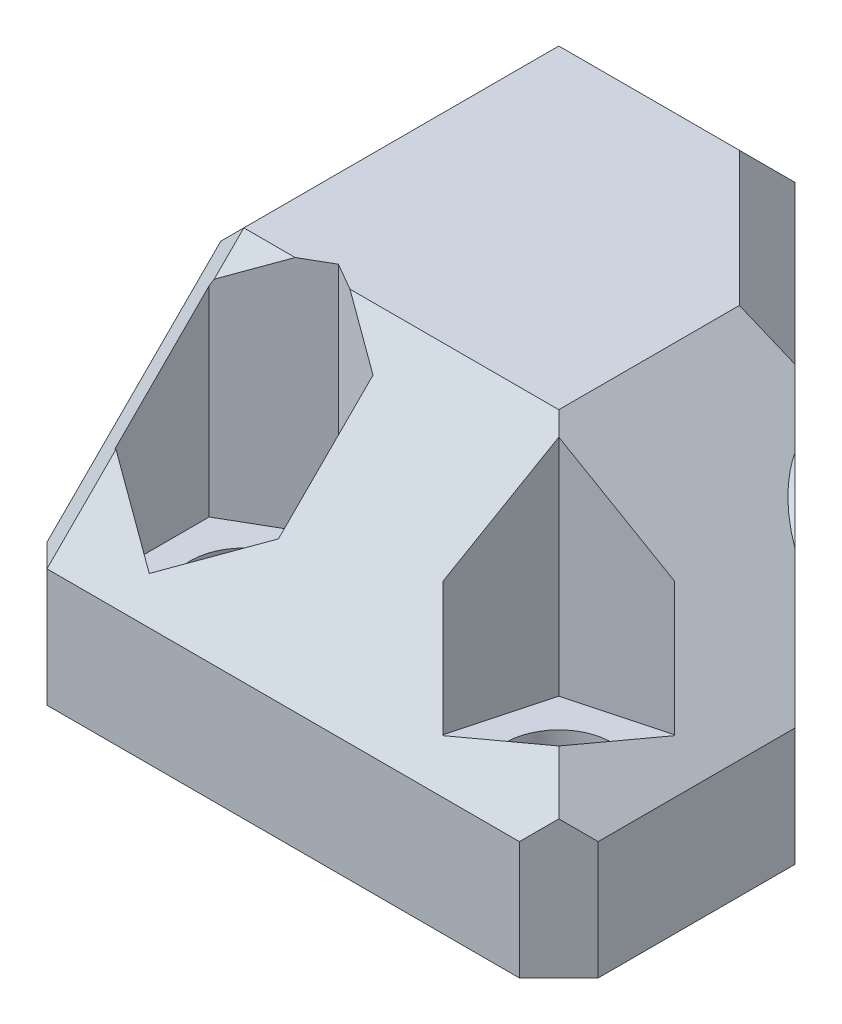
ISO-10303-21;
HEADER;
FILE_DESCRIPTION(('STEP AP214'),'2;1');
FILE_NAME('part.step','',(''),(''),'','','');
FILE_SCHEMA(('AUTOMOTIVE_DESIGN { 1 0 10303 214 1 1 1 1 }'));
ENDSEC;
DATA;
#1=APPLICATION_CONTEXT('core data for automotive mechanical design processes');
#2=APPLICATION_PROTOCOL_DEFINITION('international standard','automotive_design',2000,#1);
#3=PRODUCT_CONTEXT('',#1,'mechanical');
#4=PRODUCT('Part','Part','',(#3));
#5=PRODUCT_RELATED_PRODUCT_CATEGORY('part','',(#4));
#6=PRODUCT_DEFINITION_FORMATION('','',#4);
#7=PRODUCT_DEFINITION_CONTEXT('part definition',#1,'design');
#8=PRODUCT_DEFINITION('design','',#6,#7);
#9=PRODUCT_DEFINITION_SHAPE('','',#8);
#10=(LENGTH_UNIT() NAMED_UNIT(*) SI_UNIT(.MILLI.,.METRE.));
#11=(NAMED_UNIT(*) PLANE_ANGLE_UNIT() SI_UNIT($,.RADIAN.));
#12=(NAMED_UNIT(*) SI_UNIT($,.STERADIAN.) SOLID_ANGLE_UNIT());
#13=UNCERTAINTY_MEASURE_WITH_UNIT(LENGTH_MEASURE(1.E-05),#10,'distance_accuracy_value','');
#14=(GEOMETRIC_REPRESENTATION_CONTEXT(3) GLOBAL_UNCERTAINTY_ASSIGNED_CONTEXT((#13)) GLOBAL_UNIT_ASSIGNED_CONTEXT((#10,
#11,#12)) REPRESENTATION_CONTEXT('',''));
#15=CARTESIAN_POINT('',(0.,0.,0.));
#16=DIRECTION('',(0.,0.,1.));
#17=DIRECTION('',(1.,0.,0.));
#18=AXIS2_PLACEMENT_3D('',#15,#16,#17);
#19=CARTESIAN_POINT('',(6.35,7.93750000000017,6.35));
#20=DIRECTION('',(0.,-0.707106781186544,-0.707106781186551));
#21=DIRECTION('',(1.,0.,0.));
#22=AXIS2_PLACEMENT_3D('',#19,#20,#21);
#23=PLANE('',#22);
#24=DIRECTION('',(1.,0.,0.));
#25=VECTOR('',#24,1.);
#26=CARTESIAN_POINT('',(6.35,6.35,7.93750000000015));
#27=LINE('',#26,#25);
#28=CARTESIAN_POINT('',(-4.7625,6.35,7.93750000000015));
#29=VERTEX_POINT('',#28);
#30=CARTESIAN_POINT('',(-2.69223868596908,6.35,7.93750000000015));
#31=VERTEX_POINT('',#30);
#32=EDGE_CURVE('E259',#29,#31,#27,.T.);
#33=ORIENTED_EDGE('',*,*,#32,.F.);
#34=DIRECTION('',(0.,-0.707106781186551,0.707106781186544));
#35=VECTOR('',#34,1.);
#36=CARTESIAN_POINT('',(-4.7625,7.93750000000017,6.35));
#37=LINE('',#36,#35);
#38=CARTESIAN_POINT('',(-4.7625,5.15473407305137,9.13276592694877));
#39=VERTEX_POINT('',#38);
#40=EDGE_CURVE('E318',#29,#39,#37,.T.);
#41=ORIENTED_EDGE('',*,*,#40,.T.);
#42=DIRECTION('',(0.774596669241482,0.447213595499961,-0.447213595499957));
#43=VECTOR('',#42,1.);
#44=CARTESIAN_POINT('',(3.8329567884187,10.1173233636527,4.17017663634744));
#45=LINE('',#44,#43);
#46=EDGE_CURVE('E293',#39,#31,#45,.T.);
#47=ORIENTED_EDGE('',*,*,#46,.T.);
#48=EDGE_LOOP('',(#33,#41,#47));
#49=FACE_BOUND('',#48,.T.);
#50=ADVANCED_FACE('F38',(#49),#23,.F.);
#51=CARTESIAN_POINT('',(11.1125,-1.5875,11.1125));
#52=DIRECTION('',(0.,1.,0.));
#53=DIRECTION('',(0.,0.,1.));
#54=AXIS2_PLACEMENT_3D('',#51,#52,#53);
#55=CYLINDRICAL_SURFACE('',#54,2.15265);
#56=CARTESIAN_POINT('',(11.1125,-6.35,11.1125));
#57=DIRECTION('',(0.,1.,0.));
#58=DIRECTION('',(0.,0.,1.));
#59=AXIS2_PLACEMENT_3D('',#56,#57,#58);
#60=CIRCLE('',#59,2.15265);
#61=CARTESIAN_POINT('',(11.1125,-6.35,13.26515));
#62=VERTEX_POINT('',#61);
#63=EDGE_CURVE('E389',#62,#62,#60,.T.);
#64=ORIENTED_EDGE('',*,*,#63,.F.);
#65=EDGE_LOOP('',(#64));
#66=FACE_BOUND('',#65,.T.);
#67=CARTESIAN_POINT('',(11.1125,-3.175,11.1125));
#68=DIRECTION('',(0.,1.,0.));
#69=DIRECTION('',(0.,0.,1.));
#70=AXIS2_PLACEMENT_3D('',#67,#68,#69);
#71=CIRCLE('',#70,2.15265);
#72=CARTESIAN_POINT('',(11.1125,-3.175,13.26515));
#73=VERTEX_POINT('',#72);
#74=EDGE_CURVE('E300',#73,#73,#71,.F.);
#75=ORIENTED_EDGE('',*,*,#74,.F.);
#76=EDGE_LOOP('',(#75));
#77=FACE_BOUND('',#76,.T.);
#78=ADVANCED_FACE('F583',(#66,#77),#55,.F.);
#79=CARTESIAN_POINT('',(-1.5875,-1.5875,11.1125));
#80=DIRECTION('',(0.,1.,0.));
#81=DIRECTION('',(0.,0.,1.));
#82=AXIS2_PLACEMENT_3D('',#79,#80,#81);
#83=CYLINDRICAL_SURFACE('',#82,2.15265);
#84=CARTESIAN_POINT('',(-1.5875,-6.35,11.1125));
#85=DIRECTION('',(0.,1.,0.));
#86=DIRECTION('',(0.,0.,1.));
#87=AXIS2_PLACEMENT_3D('',#84,#85,#86);
#88=CIRCLE('',#87,2.15265);
#89=CARTESIAN_POINT('',(-1.5875,-6.35,13.26515));
#90=VERTEX_POINT('',#89);
#91=EDGE_CURVE('E265',#90,#90,#88,.T.);
#92=ORIENTED_EDGE('',*,*,#91,.F.);
#93=EDGE_LOOP('',(#92));
#94=FACE_BOUND('',#93,.T.);
#95=CARTESIAN_POINT('',(-1.5875,-3.175,11.1125));
#96=DIRECTION('',(0.,1.,0.));
#97=DIRECTION('',(0.,0.,1.));
#98=AXIS2_PLACEMENT_3D('',#95,#96,#97);
#99=CIRCLE('',#98,2.15265);
#100=CARTESIAN_POINT('',(-1.5875,-3.175,13.26515));
#101=VERTEX_POINT('',#100);
#102=EDGE_CURVE('E297',#101,#101,#99,.F.);
#103=ORIENTED_EDGE('',*,*,#102,.F.);
#104=EDGE_LOOP('',(#103));
#105=FACE_BOUND('',#104,.T.);
#106=ADVANCED_FACE('F588',(#94,#105),#83,.F.);
#107=CARTESIAN_POINT('',(15.875,-1.5875,6.35));
#108=DIRECTION('',(-0.707106781186547,0.,0.707106781186548));
#109=DIRECTION('',(0.,1.,0.));
#110=AXIS2_PLACEMENT_3D('',#107,#108,#109);
#111=PLANE('',#110);
#112=DIRECTION('',(0.,1.,0.));
#113=VECTOR('',#112,1.);
#114=CARTESIAN_POINT('',(3.17499999999996,-6.35,-6.35));
#115=LINE('',#114,#113);
#116=CARTESIAN_POINT('',(3.17499999999996,-6.35,-6.35));
#117=VERTEX_POINT('',#116);
#118=CARTESIAN_POINT('',(3.17499999999996,4.7625,-6.35));
#119=VERTEX_POINT('',#118);
#120=EDGE_CURVE('E224',#117,#119,#115,.T.);
#121=ORIENTED_EDGE('',*,*,#120,.T.);
#122=DIRECTION('',(0.707106781186548,0.,0.707106781186547));
#123=VECTOR('',#122,1.);
#124=CARTESIAN_POINT('',(7.93750000000013,4.7625,-1.58749999999986));
#125=LINE('',#124,#123);
#126=CARTESIAN_POINT('',(9.52500000000006,4.7625,0.));
#127=VERTEX_POINT('',#126);
#128=EDGE_CURVE('E326',#119,#127,#125,.T.);
#129=ORIENTED_EDGE('',*,*,#128,.T.);
#130=DIRECTION('',(0.577350269189624,-0.57735026918963,0.577350269189624));
#131=VECTOR('',#130,1.);
#132=CARTESIAN_POINT('',(15.875,-1.5875,6.35));
#133=LINE('',#132,#131);
#134=CARTESIAN_POINT('',(11.0656989864977,3.22180101350233,1.54069898649773));
#135=VERTEX_POINT('',#134);
#136=EDGE_CURVE('E256',#127,#135,#133,.T.);
#137=ORIENTED_EDGE('',*,*,#136,.T.);
#138=CARTESIAN_POINT('',(9.52499999999999,0.,0.));
#139=DIRECTION('',(-0.707106781186547,0.,0.707106781186548));
#140=DIRECTION('',(-0.707106781186548,0.,-0.707106781186547));
#141=AXIS2_PLACEMENT_3D('',#138,#139,#140);
#142=ELLIPSE('',#141,5.05049604248929,3.57124);
#143=CARTESIAN_POINT('',(12.7468010135024,1.54069898649765,3.22180101350238));
#144=VERTEX_POINT('',#143);
#145=EDGE_CURVE('E304',#135,#144,#142,.T.);
#146=ORIENTED_EDGE('',*,*,#145,.T.);
#147=CARTESIAN_POINT('',(15.875,-1.5875,6.35));
#148=VERTEX_POINT('',#147);
#149=EDGE_CURVE('E255',#144,#148,#133,.T.);
#150=ORIENTED_EDGE('',*,*,#149,.T.);
#151=DIRECTION('',(0.,-1.,0.));
#152=VECTOR('',#151,1.);
#153=CARTESIAN_POINT('',(15.875,-1.5875,6.35));
#154=LINE('',#153,#152);
#155=CARTESIAN_POINT('',(15.875,-6.35,6.35));
#156=VERTEX_POINT('',#155);
#157=EDGE_CURVE('E227',#148,#156,#154,.T.);
#158=ORIENTED_EDGE('',*,*,#157,.T.);
#159=DIRECTION('',(0.707106781186548,0.,0.707106781186547));
#160=VECTOR('',#159,1.);
#161=CARTESIAN_POINT('',(4.76249999999999,-6.35,-4.7625));
#162=LINE('',#161,#160);
#163=EDGE_CURVE('E220',#156,#117,#162,.F.);
#164=ORIENTED_EDGE('',*,*,#163,.T.);
#165=EDGE_LOOP('',(#121,#129,#137,#146,#150,#158,#164));
#166=FACE_BOUND('',#165,.T.);
#167=ADVANCED_FACE('F222',(#166),#111,.F.);
#168=CARTESIAN_POINT('',(-6.35,6.35,6.35));
#169=DIRECTION('',(1.,0.,0.));
#170=DIRECTION('',(0.,0.,-1.));
#171=AXIS2_PLACEMENT_3D('',#168,#169,#170);
#172=PLANE('',#171);
#173=CARTESIAN_POINT('',(-6.35,0.,0.));
#174=DIRECTION('',(-1.,0.,0.));
#175=DIRECTION('',(0.,0.,1.));
#176=AXIS2_PLACEMENT_3D('',#173,#174,#175);
#177=CIRCLE('',#176,4.61010000000001);
#178=CARTESIAN_POINT('',(-6.35,0.,4.61010000000001));
#179=VERTEX_POINT('',#178);
#180=EDGE_CURVE('E400',#179,#179,#177,.T.);
#181=ORIENTED_EDGE('',*,*,#180,.F.);
#182=EDGE_LOOP('',(#181));
#183=FACE_BOUND('',#182,.T.);
#184=DIRECTION('',(0.,0.,1.));
#185=VECTOR('',#184,1.);
#186=CARTESIAN_POINT('',(-6.35,-6.35,6.35));
#187=LINE('',#186,#185);
#188=CARTESIAN_POINT('',(-6.35,-6.35,-4.7625));
#189=VERTEX_POINT('',#188);
#190=CARTESIAN_POINT('',(-6.35,-6.35,14.2875));
#191=VERTEX_POINT('',#190);
#192=EDGE_CURVE('E247',#189,#191,#187,.T.);
#193=ORIENTED_EDGE('',*,*,#192,.T.);
#194=DIRECTION('',(0.,1.,0.));
#195=VECTOR('',#194,1.);
#196=CARTESIAN_POINT('',(-6.35,-1.5875,14.2875));
#197=LINE('',#196,#195);
#198=CARTESIAN_POINT('',(-6.35,-2.24506403026721,14.2875));
#199=VERTEX_POINT('',#198);
#200=EDGE_CURVE('E343',#191,#199,#197,.T.);
#201=ORIENTED_EDGE('',*,*,#200,.T.);
#202=DIRECTION('',(0.,0.707106781186551,-0.707106781186544));
#203=VECTOR('',#202,1.);
#204=CARTESIAN_POINT('',(-6.35,6.02121798486644,6.02121798486644));
#205=LINE('',#204,#203);
#206=CARTESIAN_POINT('',(-6.35,4.7625,7.27993596973286));
#207=VERTEX_POINT('',#206);
#208=EDGE_CURVE('E341',#199,#207,#205,.T.);
#209=ORIENTED_EDGE('',*,*,#208,.T.);
#210=DIRECTION('',(0.,0.,-1.));
#211=VECTOR('',#210,1.);
#212=CARTESIAN_POINT('',(-6.35,4.7625,-6.35));
#213=LINE('',#212,#211);
#214=CARTESIAN_POINT('',(-6.35,4.7625,-4.7625));
#215=VERTEX_POINT('',#214);
#216=EDGE_CURVE('E339',#207,#215,#213,.T.);
#217=ORIENTED_EDGE('',*,*,#216,.T.);
#218=DIRECTION('',(0.,-1.,0.));
#219=VECTOR('',#218,1.);
#220=CARTESIAN_POINT('',(-6.35,6.35,-4.7625));
#221=LINE('',#220,#219);
#222=EDGE_CURVE('E337',#215,#189,#221,.T.);
#223=ORIENTED_EDGE('',*,*,#222,.T.);
#224=EDGE_LOOP('',(#193,#201,#209,#217,#223));
#225=FACE_BOUND('',#224,.T.);
#226=ADVANCED_FACE('F513',(#183,#225),#172,.F.);
#227=CARTESIAN_POINT('',(6.35,6.35,-6.35));
#228=DIRECTION('',(0.,0.,1.));
#229=DIRECTION('',(1.,0.,0.));
#230=AXIS2_PLACEMENT_3D('',#227,#228,#229);
#231=PLANE('',#230);
#232=DIRECTION('',(0.,1.,0.));
#233=VECTOR('',#232,1.);
#234=CARTESIAN_POINT('',(-4.7625,6.35,-6.35));
#235=LINE('',#234,#233);
#236=CARTESIAN_POINT('',(-4.7625,-6.35,-6.35));
#237=VERTEX_POINT('',#236);
#238=CARTESIAN_POINT('',(-4.7625,4.7625,-6.35));
#239=VERTEX_POINT('',#238);
#240=EDGE_CURVE('E334',#237,#239,#235,.T.);
#241=ORIENTED_EDGE('',*,*,#240,.T.);
#242=DIRECTION('',(1.,0.,0.));
#243=VECTOR('',#242,1.);
#244=CARTESIAN_POINT('',(3.17499999999996,4.7625,-6.35));
#245=LINE('',#244,#243);
#246=EDGE_CURVE('E240',#239,#119,#245,.T.);
#247=ORIENTED_EDGE('',*,*,#246,.T.);
#248=ORIENTED_EDGE('',*,*,#120,.F.);
#249=DIRECTION('',(-1.,0.,0.));
#250=VECTOR('',#249,1.);
#251=CARTESIAN_POINT('',(6.35,-6.35,-6.35));
#252=LINE('',#251,#250);
#253=EDGE_CURVE('E233',#117,#237,#252,.T.);
#254=ORIENTED_EDGE('',*,*,#253,.T.);
#255=EDGE_LOOP('',(#241,#247,#248,#254));
#256=FACE_BOUND('',#255,.T.);
#257=ADVANCED_FACE('F237',(#256),#231,.F.);
#258=CARTESIAN_POINT('',(0.,6.35,0.));
#259=DIRECTION('',(0.,1.,0.));
#260=DIRECTION('',(0.,0.,1.));
#261=AXIS2_PLACEMENT_3D('',#258,#259,#260);
#262=PLANE('',#261);
#263=DIRECTION('',(0.,0.,-1.));
#264=VECTOR('',#263,1.);
#265=CARTESIAN_POINT('',(7.93750000000015,6.35,6.35));
#266=LINE('',#265,#264);
#267=CARTESIAN_POINT('',(7.93750000000015,6.35,7.93750000000015));
#268=VERTEX_POINT('',#267);
#269=CARTESIAN_POINT('',(7.93750000000015,6.35,0.657564030267451));
#270=VERTEX_POINT('',#269);
#271=EDGE_CURVE('E232',#268,#270,#266,.T.);
#272=ORIENTED_EDGE('',*,*,#271,.T.);
#273=DIRECTION('',(-0.707106781186548,0.,-0.707106781186547));
#274=VECTOR('',#273,1.);
#275=CARTESIAN_POINT('',(2.05246798486633,6.35,-5.22746798486637));
#276=LINE('',#275,#274);
#277=CARTESIAN_POINT('',(2.51743596973269,6.35,-4.7625));
#278=VERTEX_POINT('',#277);
#279=EDGE_CURVE('E332',#270,#278,#276,.T.);
#280=ORIENTED_EDGE('',*,*,#279,.T.);
#281=DIRECTION('',(-1.,0.,0.));
#282=VECTOR('',#281,1.);
#283=CARTESIAN_POINT('',(-6.35,6.35,-4.7625));
#284=LINE('',#283,#282);
#285=CARTESIAN_POINT('',(-4.7625,6.35,-4.7625));
#286=VERTEX_POINT('',#285);
#287=EDGE_CURVE('E330',#278,#286,#284,.T.);
#288=ORIENTED_EDGE('',*,*,#287,.T.);
#289=DIRECTION('',(0.,0.,1.));
#290=VECTOR('',#289,1.);
#291=CARTESIAN_POINT('',(-4.7625,6.35,7.93750000000015));
#292=LINE('',#291,#290);
#293=EDGE_CURVE('E328',#286,#29,#292,.T.);
#294=ORIENTED_EDGE('',*,*,#293,.T.);
#295=ORIENTED_EDGE('',*,*,#32,.T.);
#296=DIRECTION('',(-0.866025403784439,0.,0.5));
#297=VECTOR('',#296,1.);
#298=CARTESIAN_POINT('',(-1.5875,6.35,7.29967882227171));
#299=LINE('',#298,#297);
#300=CARTESIAN_POINT('',(-1.5875,6.35,7.29967882227171));
#301=VERTEX_POINT('',#300);
#302=EDGE_CURVE('E415',#301,#31,#299,.T.);
#303=ORIENTED_EDGE('',*,*,#302,.F.);
#304=DIRECTION('',(-0.866025403784438,0.,-0.5));
#305=VECTOR('',#304,1.);
#306=CARTESIAN_POINT('',(1.7145,6.35,9.20608941113585));
#307=LINE('',#306,#305);
#308=CARTESIAN_POINT('',(-0.48276131403092,6.35,7.93750000000015));
#309=VERTEX_POINT('',#308);
#310=EDGE_CURVE('E447',#309,#301,#307,.T.);
#311=ORIENTED_EDGE('',*,*,#310,.F.);
#312=EDGE_CURVE('E258',#309,#268,#27,.T.);
#313=ORIENTED_EDGE('',*,*,#312,.T.);
#314=EDGE_LOOP('',(#272,#280,#288,#294,#295,#303,#311,#313));
#315=FACE_BOUND('',#314,.T.);
#316=ADVANCED_FACE('F504',(#315),#262,.T.);
#317=CARTESIAN_POINT('',(0.,-6.35,0.));
#318=DIRECTION('',(0.,1.,0.));
#319=DIRECTION('',(0.,0.,1.));
#320=AXIS2_PLACEMENT_3D('',#317,#318,#319);
#321=PLANE('',#320);
#322=ORIENTED_EDGE('',*,*,#91,.T.);
#323=EDGE_LOOP('',(#322));
#324=FACE_BOUND('',#323,.T.);
#325=ORIENTED_EDGE('',*,*,#63,.T.);
#326=EDGE_LOOP('',(#325));
#327=FACE_BOUND('',#326,.T.);
#328=DIRECTION('',(0.,0.,1.));
#329=VECTOR('',#328,1.);
#330=CARTESIAN_POINT('',(15.875,-6.35,6.35));
#331=LINE('',#330,#329);
#332=CARTESIAN_POINT('',(15.875,-6.35,14.2875));
#333=VERTEX_POINT('',#332);
#334=EDGE_CURVE('E385',#156,#333,#331,.T.);
#335=ORIENTED_EDGE('',*,*,#334,.T.);
#336=DIRECTION('',(0.70710678118655,0.,-0.707106781186545));
#337=VECTOR('',#336,1.);
#338=CARTESIAN_POINT('',(15.875,-6.35,14.2875));
#339=LINE('',#338,#337);
#340=CARTESIAN_POINT('',(14.2875,-6.35,15.875));
#341=VERTEX_POINT('',#340);
#342=EDGE_CURVE('E310',#333,#341,#339,.F.);
#343=ORIENTED_EDGE('',*,*,#342,.T.);
#344=DIRECTION('',(-1.,0.,0.));
#345=VECTOR('',#344,1.);
#346=CARTESIAN_POINT('',(-6.35,-6.35,15.875));
#347=LINE('',#346,#345);
#348=CARTESIAN_POINT('',(-4.7625,-6.35,15.875));
#349=VERTEX_POINT('',#348);
#350=EDGE_CURVE('E380',#341,#349,#347,.T.);
#351=ORIENTED_EDGE('',*,*,#350,.T.);
#352=DIRECTION('',(-0.707106781186548,0.,-0.707106781186547));
#353=VECTOR('',#352,1.);
#354=CARTESIAN_POINT('',(-4.7625,-6.35,15.875));
#355=LINE('',#354,#353);
#356=EDGE_CURVE('E308',#349,#191,#355,.T.);
#357=ORIENTED_EDGE('',*,*,#356,.T.);
#358=ORIENTED_EDGE('',*,*,#192,.F.);
#359=DIRECTION('',(-0.707106781186548,0.,0.707106781186547));
#360=VECTOR('',#359,1.);
#361=CARTESIAN_POINT('',(-6.35,-6.35,-4.7625));
#362=LINE('',#361,#360);
#363=EDGE_CURVE('E246',#189,#237,#362,.F.);
#364=ORIENTED_EDGE('',*,*,#363,.T.);
#365=ORIENTED_EDGE('',*,*,#253,.F.);
#366=ORIENTED_EDGE('',*,*,#163,.F.);
#367=EDGE_LOOP('',(#335,#343,#351,#357,#358,#364,#365,#366));
#368=FACE_BOUND('',#367,.T.);
#369=ADVANCED_FACE('F243',(#324,#327,#368),#321,.F.);
#370=CARTESIAN_POINT('',(-6.35,-1.5875,15.875));
#371=DIRECTION('',(0.,0.,1.));
#372=DIRECTION('',(1.,0.,0.));
#373=AXIS2_PLACEMENT_3D('',#370,#371,#372);
#374=PLANE('',#373);
#375=ORIENTED_EDGE('',*,*,#350,.F.);
#376=DIRECTION('',(0.,1.,0.));
#377=VECTOR('',#376,1.);
#378=CARTESIAN_POINT('',(14.2875,-1.5875,15.875));
#379=LINE('',#378,#377);
#380=CARTESIAN_POINT('',(14.2875,-1.5875,15.875));
#381=VERTEX_POINT('',#380);
#382=EDGE_CURVE('E314',#341,#381,#379,.T.);
#383=ORIENTED_EDGE('',*,*,#382,.T.);
#384=DIRECTION('',(-1.,0.,0.));
#385=VECTOR('',#384,1.);
#386=CARTESIAN_POINT('',(-6.35,-1.5875,15.875));
#387=LINE('',#386,#385);
#388=CARTESIAN_POINT('',(-4.7625,-1.5875,15.875));
#389=VERTEX_POINT('',#388);
#390=EDGE_CURVE('E383',#381,#389,#387,.T.);
#391=ORIENTED_EDGE('',*,*,#390,.T.);
#392=DIRECTION('',(0.,-1.,0.));
#393=VECTOR('',#392,1.);
#394=CARTESIAN_POINT('',(-4.7625,-6.35,15.875));
#395=LINE('',#394,#393);
#396=EDGE_CURVE('E312',#389,#349,#395,.T.);
#397=ORIENTED_EDGE('',*,*,#396,.T.);
#398=EDGE_LOOP('',(#375,#383,#391,#397));
#399=FACE_BOUND('',#398,.T.);
#400=ADVANCED_FACE('F379',(#399),#374,.T.);
#401=CARTESIAN_POINT('',(15.875,-1.5875,6.35));
#402=DIRECTION('',(1.,0.,0.));
#403=DIRECTION('',(0.,0.,-1.));
#404=AXIS2_PLACEMENT_3D('',#401,#402,#403);
#405=PLANE('',#404);
#406=DIRECTION('',(0.,0.,1.));
#407=VECTOR('',#406,1.);
#408=CARTESIAN_POINT('',(15.875,-1.5875,6.35));
#409=LINE('',#408,#407);
#410=CARTESIAN_POINT('',(15.875,-1.5875,14.2875));
#411=VERTEX_POINT('',#410);
#412=EDGE_CURVE('E384',#148,#411,#409,.T.);
#413=ORIENTED_EDGE('',*,*,#412,.T.);
#414=DIRECTION('',(0.,-1.,0.));
#415=VECTOR('',#414,1.);
#416=CARTESIAN_POINT('',(15.875,-1.5875,14.2875));
#417=LINE('',#416,#415);
#418=EDGE_CURVE('E296',#411,#333,#417,.T.);
#419=ORIENTED_EDGE('',*,*,#418,.T.);
#420=ORIENTED_EDGE('',*,*,#334,.F.);
#421=ORIENTED_EDGE('',*,*,#157,.F.);
#422=EDGE_LOOP('',(#413,#419,#420,#421));
#423=FACE_BOUND('',#422,.T.);
#424=ADVANCED_FACE('F537',(#423),#405,.T.);
#425=ORIENTED_EDGE('',*,*,#390,.F.);
#426=DIRECTION('',(-0.577350269189626,-0.577350269189628,0.577350269189623));
#427=VECTOR('',#426,1.);
#428=CARTESIAN_POINT('',(15.3458333333333,-0.52916666666662,14.8166666666667));
#429=LINE('',#428,#427);
#430=CARTESIAN_POINT('',(15.08125,-0.793749999999925,15.08125));
#431=VERTEX_POINT('',#430);
#432=EDGE_CURVE('E320',#381,#431,#429,.F.);
#433=ORIENTED_EDGE('',*,*,#432,.T.);
#434=DIRECTION('',(0.577350269189624,-0.57735026918963,0.577350269189624));
#435=VECTOR('',#434,1.);
#436=CARTESIAN_POINT('',(6.35,7.93750000000017,6.35));
#437=LINE('',#436,#435);
#438=CARTESIAN_POINT('',(13.8085717102234,0.478928289776733,13.8085717102234));
#439=VERTEX_POINT('',#438);
#440=EDGE_CURVE('E262',#439,#431,#437,.T.);
#441=ORIENTED_EDGE('',*,*,#440,.F.);
#442=DIRECTION('',(-0.935113126531029,-0.250562807085733,0.250562807085731));
#443=VECTOR('',#442,1.);
#444=CARTESIAN_POINT('',(10.7816787994753,-0.332125221233701,14.6196252212338));
#445=LINE('',#444,#443);
#446=CARTESIAN_POINT('',(10.1256692636337,-0.507902446589571,14.7954024465897));
#447=VERTEX_POINT('',#446);
#448=EDGE_CURVE('E301',#439,#447,#445,.T.);
#449=ORIENTED_EDGE('',*,*,#448,.T.);
#450=DIRECTION('',(-0.577350269189626,0.577350269189629,-0.577350269189623));
#451=VECTOR('',#450,1.);
#452=CARTESIAN_POINT('',(3.236844544696,6.38092227234816,7.90657772765199));
#453=LINE('',#452,#451);
#454=CARTESIAN_POINT('',(7.42959755341035,2.1881692636338,12.0993307363663));
#455=VERTEX_POINT('',#454);
#456=EDGE_CURVE('E278',#447,#455,#453,.T.);
#457=ORIENTED_EDGE('',*,*,#456,.T.);
#458=DIRECTION('',(0.186156787897383,0.69474659060687,-0.694746590606863));
#459=VECTOR('',#458,1.);
#460=CARTESIAN_POINT('',(8.87932731581346,7.59863439416707,6.68886560583309));
#461=LINE('',#460,#459);
#462=CARTESIAN_POINT('',(8.41642828977664,5.8710717102235,8.41642828977665));
#463=VERTEX_POINT('',#462);
#464=EDGE_CURVE('E409',#455,#463,#461,.T.);
#465=ORIENTED_EDGE('',*,*,#464,.T.);
#466=EDGE_CURVE('E266',#268,#463,#437,.T.);
#467=ORIENTED_EDGE('',*,*,#466,.F.);
#468=ORIENTED_EDGE('',*,*,#312,.F.);
#469=DIRECTION('',(0.774596669241482,-0.447213595499962,0.447213595499957));
#470=VECTOR('',#469,1.);
#471=CARTESIAN_POINT('',(2.51704321158127,4.61806204962153,9.6694379503786));
#472=LINE('',#471,#470);
#473=CARTESIAN_POINT('',(1.7145,5.08141058886428,9.20608941113585));
#474=VERTEX_POINT('',#473);
#475=EDGE_CURVE('E290',#309,#474,#472,.T.);
#476=ORIENTED_EDGE('',*,*,#475,.T.);
#477=DIRECTION('',(0.,-0.707106781186551,0.707106781186544));
#478=VECTOR('',#477,1.);
#479=CARTESIAN_POINT('',(1.7145,7.93750000000017,6.35));
#480=LINE('',#479,#478);
#481=CARTESIAN_POINT('',(1.7145,1.26858941113595,13.0189105888642));
#482=VERTEX_POINT('',#481);
#483=EDGE_CURVE('E287',#474,#482,#480,.T.);
#484=ORIENTED_EDGE('',*,*,#483,.T.);
#485=DIRECTION('',(-0.774596669241482,-0.447213595499961,0.447213595499957));
#486=VECTOR('',#485,1.);
#487=CARTESIAN_POINT('',(9.11615678841873,5.54193795037876,8.74556204962138));
#488=LINE('',#487,#486);
#489=CARTESIAN_POINT('',(-1.5875,-0.637821177728212,14.9253211777283));
#490=VERTEX_POINT('',#489);
#491=EDGE_CURVE('E284',#482,#490,#488,.T.);
#492=ORIENTED_EDGE('',*,*,#491,.T.);
#493=DIRECTION('',(-0.774596669241482,0.447213595499962,-0.447213595499957));
#494=VECTOR('',#493,1.);
#495=CARTESIAN_POINT('',(-2.76615678841877,0.0426766363475495,14.2448233636525));
#496=LINE('',#495,#494);
#497=CARTESIAN_POINT('',(-4.7625,1.19526592694887,13.0922340730512));
#498=VERTEX_POINT('',#497);
#499=EDGE_CURVE('E281',#490,#498,#496,.T.);
#500=ORIENTED_EDGE('',*,*,#499,.T.);
#501=DIRECTION('',(0.,-0.707106781186551,0.707106781186544));
#502=VECTOR('',#501,1.);
#503=CARTESIAN_POINT('',(-4.7625,7.93750000000017,6.35));
#504=LINE('',#503,#502);
#505=EDGE_CURVE('E316',#498,#389,#504,.T.);
#506=ORIENTED_EDGE('',*,*,#505,.T.);
#507=EDGE_LOOP('',(#425,#433,#441,#449,#457,#465,#467,#468,#476,#484,#492,#500,#506));
#508=FACE_BOUND('',#507,.T.);
#509=ADVANCED_FACE('F489',(#508),#23,.F.);
#510=CARTESIAN_POINT('',(6.35,7.93750000000017,6.35));
#511=DIRECTION('',(-0.707106781186551,-0.707106781186544,0.));
#512=DIRECTION('',(0.,0.,-1.));
#513=AXIS2_PLACEMENT_3D('',#510,#511,#512);
#514=PLANE('',#513);
#515=ORIENTED_EDGE('',*,*,#440,.T.);
#516=DIRECTION('',(-0.577350269189625,0.577350269189631,0.577350269189621));
#517=VECTOR('',#516,1.);
#518=CARTESIAN_POINT('',(15.875,-1.5875,14.2875));
#519=LINE('',#518,#517);
#520=EDGE_CURVE('E324',#431,#411,#519,.F.);
#521=ORIENTED_EDGE('',*,*,#520,.T.);
#522=ORIENTED_EDGE('',*,*,#412,.F.);
#523=ORIENTED_EDGE('',*,*,#149,.F.);
#524=CARTESIAN_POINT('',(14.2875000000001,0.,0.));
#525=DIRECTION('',(-0.707106781186551,-0.707106781186544,0.));
#526=DIRECTION('',(-0.707106781186544,0.707106781186551,0.));
#527=AXIS2_PLACEMENT_3D('',#524,#525,#526);
#528=ELLIPSE('',#527,5.05049604248926,3.57124);
#529=EDGE_CURVE('E261',#144,#135,#528,.T.);
#530=ORIENTED_EDGE('',*,*,#529,.T.);
#531=ORIENTED_EDGE('',*,*,#136,.F.);
#532=DIRECTION('',(-0.678598344545842,0.678598344545849,0.28108463771483));
#533=VECTOR('',#532,1.);
#534=CARTESIAN_POINT('',(11.2379261105254,3.04957388947475,-0.709517226322435));
#535=LINE('',#534,#533);
#536=EDGE_CURVE('E322',#127,#270,#535,.T.);
#537=ORIENTED_EDGE('',*,*,#536,.T.);
#538=ORIENTED_EDGE('',*,*,#271,.F.);
#539=ORIENTED_EDGE('',*,*,#466,.T.);
#540=DIRECTION('',(0.694746590606862,-0.694746590606869,-0.186156787897386));
#541=VECTOR('',#540,1.);
#542=CARTESIAN_POINT('',(6.6888656058331,7.59863439416706,8.87932731581347));
#543=LINE('',#542,#541);
#544=CARTESIAN_POINT('',(12.0993307363663,2.18816926363381,7.42959755341035));
#545=VERTEX_POINT('',#544);
#546=EDGE_CURVE('E275',#463,#545,#543,.T.);
#547=ORIENTED_EDGE('',*,*,#546,.T.);
#548=DIRECTION('',(0.577350269189624,-0.57735026918963,0.577350269189623));
#549=VECTOR('',#548,1.);
#550=CARTESIAN_POINT('',(7.90657772765197,6.38092227234818,3.23684454469602));
#551=LINE('',#550,#549);
#552=CARTESIAN_POINT('',(14.7954024465896,-0.507902446589569,10.1256692636337));
#553=VERTEX_POINT('',#552);
#554=EDGE_CURVE('E272',#545,#553,#551,.T.);
#555=ORIENTED_EDGE('',*,*,#554,.T.);
#556=DIRECTION('',(-0.250562807085731,0.250562807085733,0.935113126531029));
#557=VECTOR('',#556,1.);
#558=CARTESIAN_POINT('',(14.6196252212338,-0.332125221233692,10.7816787994753));
#559=LINE('',#558,#557);
#560=EDGE_CURVE('E269',#553,#439,#559,.T.);
#561=ORIENTED_EDGE('',*,*,#560,.T.);
#562=EDGE_LOOP('',(#515,#521,#522,#523,#530,#531,#537,#538,#539,#547,#555,#561));
#563=FACE_BOUND('',#562,.T.);
#564=ADVANCED_FACE('F529',(#563),#514,.F.);
#565=CARTESIAN_POINT('',(1.27,0.,0.));
#566=DIRECTION('',(1.,0.,0.));
#567=DIRECTION('',(0.,0.,-1.));
#568=AXIS2_PLACEMENT_3D('',#565,#566,#567);
#569=PLANE('',#568);
#570=CARTESIAN_POINT('',(1.27,0.,0.));
#571=DIRECTION('',(1.,0.,0.));
#572=DIRECTION('',(0.,0.,-1.));
#573=AXIS2_PLACEMENT_3D('',#570,#571,#572);
#574=CIRCLE('',#573,3.57124);
#575=CARTESIAN_POINT('',(1.27,0.,-3.57124));
#576=VERTEX_POINT('',#575);
#577=EDGE_CURVE('E403',#576,#576,#574,.T.);
#578=ORIENTED_EDGE('',*,*,#577,.T.);
#579=EDGE_LOOP('',(#578));
#580=FACE_BOUND('',#579,.T.);
#581=CARTESIAN_POINT('',(1.27,0.,0.));
#582=DIRECTION('',(-1.,0.,0.));
#583=DIRECTION('',(0.,0.,1.));
#584=AXIS2_PLACEMENT_3D('',#581,#582,#583);
#585=CIRCLE('',#584,4.43230000000001);
#586=CARTESIAN_POINT('',(1.27,0.,4.43230000000001));
#587=VERTEX_POINT('',#586);
#588=EDGE_CURVE('E397',#587,#587,#585,.T.);
#589=ORIENTED_EDGE('',*,*,#588,.T.);
#590=EDGE_LOOP('',(#589));
#591=FACE_BOUND('',#590,.T.);
#592=ADVANCED_FACE('F598',(#580,#591),#569,.F.);
#593=CARTESIAN_POINT('',(-6.35,0.,0.));
#594=DIRECTION('',(-1.,0.,0.));
#595=DIRECTION('',(0.,0.,1.));
#596=AXIS2_PLACEMENT_3D('',#593,#594,#595);
#597=CONICAL_SURFACE('',#596,4.61010000000001,0.0233291001481867);
#598=ORIENTED_EDGE('',*,*,#588,.F.);
#599=EDGE_LOOP('',(#598));
#600=FACE_BOUND('',#599,.T.);
#601=ORIENTED_EDGE('',*,*,#180,.T.);
#602=EDGE_LOOP('',(#601));
#603=FACE_BOUND('',#602,.T.);
#604=ADVANCED_FACE('F628',(#600,#603),#597,.F.);
#605=CARTESIAN_POINT('',(-6.35,0.,0.));
#606=DIRECTION('',(-1.,0.,0.));
#607=DIRECTION('',(0.,0.,1.));
#608=AXIS2_PLACEMENT_3D('',#605,#606,#607);
#609=CYLINDRICAL_SURFACE('',#608,3.57124);
#610=ORIENTED_EDGE('',*,*,#529,.F.);
#611=ORIENTED_EDGE('',*,*,#145,.F.);
#612=EDGE_LOOP('',(#610,#611));
#613=FACE_BOUND('',#612,.T.);
#614=ORIENTED_EDGE('',*,*,#577,.F.);
#615=EDGE_LOOP('',(#614));
#616=FACE_BOUND('',#615,.T.);
#617=ADVANCED_FACE('F534',(#613,#616),#609,.F.);
#618=CARTESIAN_POINT('',(0.,-3.175,0.));
#619=DIRECTION('',(0.,1.,0.));
#620=DIRECTION('',(0.,0.,1.));
#621=AXIS2_PLACEMENT_3D('',#618,#619,#620);
#622=PLANE('',#621);
#623=DIRECTION('',(0.965925826289068,0.,-0.258819045102522));
#624=VECTOR('',#623,1.);
#625=CARTESIAN_POINT('',(12.0993307363663,-3.175,7.42959755341034));
#626=LINE('',#625,#624);
#627=CARTESIAN_POINT('',(8.41642828977664,-3.175,8.41642828977665));
#628=VERTEX_POINT('',#627);
#629=CARTESIAN_POINT('',(12.0993307363663,-3.175,7.42959755341035));
#630=VERTEX_POINT('',#629);
#631=EDGE_CURVE('E416',#628,#630,#626,.T.);
#632=ORIENTED_EDGE('',*,*,#631,.F.);
#633=DIRECTION('',(0.258819045102519,0.,-0.965925826289069));
#634=VECTOR('',#633,1.);
#635=CARTESIAN_POINT('',(8.41642828977664,-3.175,8.41642828977665));
#636=LINE('',#635,#634);
#637=CARTESIAN_POINT('',(7.42959755341035,-3.175,12.0993307363663));
#638=VERTEX_POINT('',#637);
#639=EDGE_CURVE('E413',#638,#628,#636,.T.);
#640=ORIENTED_EDGE('',*,*,#639,.F.);
#641=DIRECTION('',(-0.70710678118655,0.,-0.707106781186545));
#642=VECTOR('',#641,1.);
#643=CARTESIAN_POINT('',(7.42959755341035,-3.175,12.0993307363663));
#644=LINE('',#643,#642);
#645=CARTESIAN_POINT('',(10.1256692636337,-3.175,14.7954024465897));
#646=VERTEX_POINT('',#645);
#647=EDGE_CURVE('E433',#646,#638,#644,.T.);
#648=ORIENTED_EDGE('',*,*,#647,.F.);
#649=DIRECTION('',(-0.965925826289069,0.,0.25881904510252));
#650=VECTOR('',#649,1.);
#651=CARTESIAN_POINT('',(10.1256692636337,-3.175,14.7954024465897));
#652=LINE('',#651,#650);
#653=CARTESIAN_POINT('',(13.8085717102233,-3.175,13.8085717102234));
#654=VERTEX_POINT('',#653);
#655=EDGE_CURVE('E439',#654,#646,#652,.T.);
#656=ORIENTED_EDGE('',*,*,#655,.F.);
#657=DIRECTION('',(-0.25881904510252,0.,0.965925826289069));
#658=VECTOR('',#657,1.);
#659=CARTESIAN_POINT('',(13.8085717102233,-3.175,13.8085717102234));
#660=LINE('',#659,#658);
#661=CARTESIAN_POINT('',(14.7954024465896,-3.175,10.1256692636337));
#662=VERTEX_POINT('',#661);
#663=EDGE_CURVE('E437',#662,#654,#660,.T.);
#664=ORIENTED_EDGE('',*,*,#663,.F.);
#665=DIRECTION('',(0.707106781186548,0.,0.707106781186547));
#666=VECTOR('',#665,1.);
#667=CARTESIAN_POINT('',(14.7954024465896,-3.175,10.1256692636337));
#668=LINE('',#667,#666);
#669=EDGE_CURVE('E435',#630,#662,#668,.T.);
#670=ORIENTED_EDGE('',*,*,#669,.F.);
#671=EDGE_LOOP('',(#632,#640,#648,#656,#664,#670));
#672=FACE_BOUND('',#671,.T.);
#673=ORIENTED_EDGE('',*,*,#74,.T.);
#674=EDGE_LOOP('',(#673));
#675=FACE_BOUND('',#674,.T.);
#676=ADVANCED_FACE('F560',(#672,#675),#622,.T.);
#677=CARTESIAN_POINT('',(7.42959755341035,-16.7668211777283,12.0993307363663));
#678=DIRECTION('',(-0.707106781186545,0.,0.70710678118655));
#679=DIRECTION('',(0.70710678118655,0.,0.707106781186545));
#680=AXIS2_PLACEMENT_3D('',#677,#678,#679);
#681=PLANE('',#680);
#682=DIRECTION('',(0.,1.,0.));
#683=VECTOR('',#682,1.);
#684=CARTESIAN_POINT('',(10.1256692636337,-16.7668211777283,14.7954024465897));
#685=LINE('',#684,#683);
#686=EDGE_CURVE('E422',#646,#447,#685,.T.);
#687=ORIENTED_EDGE('',*,*,#686,.F.);
#688=ORIENTED_EDGE('',*,*,#647,.T.);
#689=DIRECTION('',(0.,1.,0.));
#690=VECTOR('',#689,1.);
#691=CARTESIAN_POINT('',(7.42959755341035,-16.7668211777283,12.0993307363663));
#692=LINE('',#691,#690);
#693=EDGE_CURVE('E419',#638,#455,#692,.T.);
#694=ORIENTED_EDGE('',*,*,#693,.T.);
#695=ORIENTED_EDGE('',*,*,#456,.F.);
#696=EDGE_LOOP('',(#687,#688,#694,#695));
#697=FACE_BOUND('',#696,.T.);
#698=ADVANCED_FACE('F566',(#697),#681,.F.);
#699=CARTESIAN_POINT('',(12.0993307363663,-16.7668211777283,7.42959755341034));
#700=DIRECTION('',(-0.258819045102522,0.,-0.965925826289068));
#701=DIRECTION('',(-0.965925826289068,0.,0.258819045102522));
#702=AXIS2_PLACEMENT_3D('',#699,#700,#701);
#703=PLANE('',#702);
#704=DIRECTION('',(0.,1.,0.));
#705=VECTOR('',#704,1.);
#706=CARTESIAN_POINT('',(8.41642828977664,-16.7668211777283,8.41642828977665));
#707=LINE('',#706,#705);
#708=EDGE_CURVE('E241',#628,#463,#707,.T.);
#709=ORIENTED_EDGE('',*,*,#708,.F.);
#710=ORIENTED_EDGE('',*,*,#631,.T.);
#711=DIRECTION('',(0.,1.,0.));
#712=VECTOR('',#711,1.);
#713=CARTESIAN_POINT('',(12.0993307363663,-16.7668211777283,7.42959755341034));
#714=LINE('',#713,#712);
#715=EDGE_CURVE('E430',#630,#545,#714,.T.);
#716=ORIENTED_EDGE('',*,*,#715,.T.);
#717=ORIENTED_EDGE('',*,*,#546,.F.);
#718=EDGE_LOOP('',(#709,#710,#716,#717));
#719=FACE_BOUND('',#718,.T.);
#720=ADVANCED_FACE('F571',(#719),#703,.F.);
#721=CARTESIAN_POINT('',(14.7954024465896,-16.7668211777283,10.1256692636337));
#722=DIRECTION('',(0.707106781186547,0.,-0.707106781186548));
#723=DIRECTION('',(-0.707106781186548,0.,-0.707106781186547));
#724=AXIS2_PLACEMENT_3D('',#721,#722,#723);
#725=PLANE('',#724);
#726=ORIENTED_EDGE('',*,*,#715,.F.);
#727=ORIENTED_EDGE('',*,*,#669,.T.);
#728=DIRECTION('',(0.,1.,0.));
#729=VECTOR('',#728,1.);
#730=CARTESIAN_POINT('',(14.7954024465896,-16.7668211777283,10.1256692636337));
#731=LINE('',#730,#729);
#732=EDGE_CURVE('E427',#662,#553,#731,.T.);
#733=ORIENTED_EDGE('',*,*,#732,.T.);
#734=ORIENTED_EDGE('',*,*,#554,.F.);
#735=EDGE_LOOP('',(#726,#727,#733,#734));
#736=FACE_BOUND('',#735,.T.);
#737=ADVANCED_FACE('F554',(#736),#725,.F.);
#738=CARTESIAN_POINT('',(13.8085717102233,-16.7668211777283,13.8085717102234));
#739=DIRECTION('',(0.965925826289069,0.,0.25881904510252));
#740=DIRECTION('',(0.25881904510252,0.,-0.965925826289069));
#741=AXIS2_PLACEMENT_3D('',#738,#739,#740);
#742=PLANE('',#741);
#743=ORIENTED_EDGE('',*,*,#732,.F.);
#744=ORIENTED_EDGE('',*,*,#663,.T.);
#745=DIRECTION('',(0.,1.,0.));
#746=VECTOR('',#745,1.);
#747=CARTESIAN_POINT('',(13.8085717102233,-16.7668211777283,13.8085717102234));
#748=LINE('',#747,#746);
#749=EDGE_CURVE('E425',#654,#439,#748,.T.);
#750=ORIENTED_EDGE('',*,*,#749,.T.);
#751=ORIENTED_EDGE('',*,*,#560,.F.);
#752=EDGE_LOOP('',(#743,#744,#750,#751));
#753=FACE_BOUND('',#752,.T.);
#754=ADVANCED_FACE('F551',(#753),#742,.F.);
#755=CARTESIAN_POINT('',(10.1256692636337,-16.7668211777283,14.7954024465897));
#756=DIRECTION('',(0.25881904510252,0.,0.965925826289068));
#757=DIRECTION('',(0.965925826289069,0.,-0.25881904510252));
#758=AXIS2_PLACEMENT_3D('',#755,#756,#757);
#759=PLANE('',#758);
#760=ORIENTED_EDGE('',*,*,#749,.F.);
#761=ORIENTED_EDGE('',*,*,#655,.T.);
#762=ORIENTED_EDGE('',*,*,#686,.T.);
#763=ORIENTED_EDGE('',*,*,#448,.F.);
#764=EDGE_LOOP('',(#760,#761,#762,#763));
#765=FACE_BOUND('',#764,.T.);
#766=ADVANCED_FACE('F547',(#765),#759,.F.);
#767=CARTESIAN_POINT('',(8.41642828977664,-16.7668211777283,8.41642828977665));
#768=DIRECTION('',(-0.965925826289069,0.,-0.258819045102519));
#769=DIRECTION('',(-0.258819045102519,0.,0.965925826289069));
#770=AXIS2_PLACEMENT_3D('',#767,#768,#769);
#771=PLANE('',#770);
#772=ORIENTED_EDGE('',*,*,#693,.F.);
#773=ORIENTED_EDGE('',*,*,#639,.T.);
#774=ORIENTED_EDGE('',*,*,#708,.T.);
#775=ORIENTED_EDGE('',*,*,#464,.F.);
#776=EDGE_LOOP('',(#772,#773,#774,#775));
#777=FACE_BOUND('',#776,.T.);
#778=ADVANCED_FACE('F568',(#777),#771,.F.);
#779=CARTESIAN_POINT('',(0.,-3.175,0.));
#780=DIRECTION('',(0.,1.,0.));
#781=DIRECTION('',(0.,0.,1.));
#782=AXIS2_PLACEMENT_3D('',#779,#780,#781);
#783=PLANE('',#782);
#784=DIRECTION('',(0.866025403784439,0.,-0.5));
#785=VECTOR('',#784,1.);
#786=CARTESIAN_POINT('',(-1.5875,-3.175,7.29967882227171));
#787=LINE('',#786,#785);
#788=CARTESIAN_POINT('',(-4.8895,-3.175,9.20608941113585));
#789=VERTEX_POINT('',#788);
#790=CARTESIAN_POINT('',(-1.5875,-3.175,7.29967882227171));
#791=VERTEX_POINT('',#790);
#792=EDGE_CURVE('E443',#789,#791,#787,.T.);
#793=ORIENTED_EDGE('',*,*,#792,.F.);
#794=DIRECTION('',(0.,0.,-1.));
#795=VECTOR('',#794,1.);
#796=CARTESIAN_POINT('',(-4.8895,-3.175,9.20608941113585));
#797=LINE('',#796,#795);
#798=CARTESIAN_POINT('',(-4.8895,-3.175,13.0189105888641));
#799=VERTEX_POINT('',#798);
#800=EDGE_CURVE('E412',#799,#789,#797,.T.);
#801=ORIENTED_EDGE('',*,*,#800,.F.);
#802=DIRECTION('',(-0.866025403784439,0.,-0.5));
#803=VECTOR('',#802,1.);
#804=CARTESIAN_POINT('',(-4.8895,-3.175,13.0189105888641));
#805=LINE('',#804,#803);
#806=CARTESIAN_POINT('',(-1.5875,-3.175,14.9253211777283));
#807=VERTEX_POINT('',#806);
#808=EDGE_CURVE('E461',#807,#799,#805,.T.);
#809=ORIENTED_EDGE('',*,*,#808,.F.);
#810=DIRECTION('',(-0.866025403784439,0.,0.5));
#811=VECTOR('',#810,1.);
#812=CARTESIAN_POINT('',(-1.5875,-3.175,14.9253211777283));
#813=LINE('',#812,#811);
#814=CARTESIAN_POINT('',(1.7145,-3.175,13.0189105888642));
#815=VERTEX_POINT('',#814);
#816=EDGE_CURVE('E470',#815,#807,#813,.T.);
#817=ORIENTED_EDGE('',*,*,#816,.F.);
#818=DIRECTION('',(0.,0.,1.));
#819=VECTOR('',#818,1.);
#820=CARTESIAN_POINT('',(1.7145,-3.175,13.0189105888642));
#821=LINE('',#820,#819);
#822=CARTESIAN_POINT('',(1.7145,-3.175,9.20608941113585));
#823=VERTEX_POINT('',#822);
#824=EDGE_CURVE('E468',#823,#815,#821,.T.);
#825=ORIENTED_EDGE('',*,*,#824,.F.);
#826=DIRECTION('',(0.866025403784439,0.,0.5));
#827=VECTOR('',#826,1.);
#828=CARTESIAN_POINT('',(1.7145,-3.175,9.20608941113585));
#829=LINE('',#828,#827);
#830=EDGE_CURVE('E466',#791,#823,#829,.T.);
#831=ORIENTED_EDGE('',*,*,#830,.F.);
#832=EDGE_LOOP('',(#793,#801,#809,#817,#825,#831));
#833=FACE_BOUND('',#832,.T.);
#834=ORIENTED_EDGE('',*,*,#102,.T.);
#835=EDGE_LOOP('',(#834));
#836=FACE_BOUND('',#835,.T.);
#837=ADVANCED_FACE('F481',(#833,#836),#783,.T.);
#838=CARTESIAN_POINT('',(-1.5875,-16.7668211777283,7.29967882227171));
#839=DIRECTION('',(-0.5,0.,-0.866025403784439));
#840=DIRECTION('',(-0.866025403784439,0.,0.5));
#841=AXIS2_PLACEMENT_3D('',#838,#839,#840);
#842=PLANE('',#841);
#843=ORIENTED_EDGE('',*,*,#46,.F.);
#844=DIRECTION('',(0.434386183155615,0.865107811303305,-0.250792979777148));
#845=VECTOR('',#844,1.);
#846=CARTESIAN_POINT('',(-4.39745561527408,5.88174326658658,8.9220074531611));
#847=LINE('',#846,#845);
#848=CARTESIAN_POINT('',(-4.8895,4.9018054664429,9.20608941113585));
#849=VERTEX_POINT('',#848);
#850=EDGE_CURVE('E62',#39,#849,#847,.F.);
#851=ORIENTED_EDGE('',*,*,#850,.T.);
#852=DIRECTION('',(0.,1.,0.));
#853=VECTOR('',#852,1.);
#854=CARTESIAN_POINT('',(-4.8895,-16.7668211777283,9.20608941113585));
#855=LINE('',#854,#853);
#856=EDGE_CURVE('E444',#789,#849,#855,.T.);
#857=ORIENTED_EDGE('',*,*,#856,.F.);
#858=ORIENTED_EDGE('',*,*,#792,.T.);
#859=DIRECTION('',(0.,1.,0.));
#860=VECTOR('',#859,1.);
#861=CARTESIAN_POINT('',(-1.5875,-16.7668211777283,7.29967882227171));
#862=LINE('',#861,#860);
#863=EDGE_CURVE('E458',#791,#301,#862,.T.);
#864=ORIENTED_EDGE('',*,*,#863,.T.);
#865=ORIENTED_EDGE('',*,*,#302,.T.);
#866=EDGE_LOOP('',(#843,#851,#857,#858,#864,#865));
#867=FACE_BOUND('',#866,.T.);
#868=ADVANCED_FACE('F486',(#867),#842,.F.);
#869=CARTESIAN_POINT('',(1.7145,-16.7668211777283,9.20608941113585));
#870=DIRECTION('',(0.5,0.,-0.866025403784439));
#871=DIRECTION('',(-0.866025403784439,0.,-0.5));
#872=AXIS2_PLACEMENT_3D('',#869,#870,#871);
#873=PLANE('',#872);
#874=ORIENTED_EDGE('',*,*,#310,.T.);
#875=ORIENTED_EDGE('',*,*,#863,.F.);
#876=ORIENTED_EDGE('',*,*,#830,.T.);
#877=DIRECTION('',(0.,1.,0.));
#878=VECTOR('',#877,1.);
#879=CARTESIAN_POINT('',(1.7145,-16.7668211777283,9.20608941113585));
#880=LINE('',#879,#878);
#881=EDGE_CURVE('E455',#823,#474,#880,.T.);
#882=ORIENTED_EDGE('',*,*,#881,.T.);
#883=ORIENTED_EDGE('',*,*,#475,.F.);
#884=EDGE_LOOP('',(#874,#875,#876,#882,#883));
#885=FACE_BOUND('',#884,.T.);
#886=ADVANCED_FACE('F497',(#885),#873,.F.);
#887=CARTESIAN_POINT('',(1.7145,-16.7668211777283,13.0189105888642));
#888=DIRECTION('',(1.,0.,0.));
#889=DIRECTION('',(0.,0.,-1.));
#890=AXIS2_PLACEMENT_3D('',#887,#888,#889);
#891=PLANE('',#890);
#892=ORIENTED_EDGE('',*,*,#881,.F.);
#893=ORIENTED_EDGE('',*,*,#824,.T.);
#894=DIRECTION('',(0.,1.,0.));
#895=VECTOR('',#894,1.);
#896=CARTESIAN_POINT('',(1.7145,-16.7668211777283,13.0189105888642));
#897=LINE('',#896,#895);
#898=EDGE_CURVE('E452',#815,#482,#897,.T.);
#899=ORIENTED_EDGE('',*,*,#898,.T.);
#900=ORIENTED_EDGE('',*,*,#483,.F.);
#901=EDGE_LOOP('',(#892,#893,#899,#900));
#902=FACE_BOUND('',#901,.T.);
#903=ADVANCED_FACE('F495',(#902),#891,.F.);
#904=CARTESIAN_POINT('',(-1.5875,-16.7668211777283,14.9253211777283));
#905=DIRECTION('',(0.5,0.,0.866025403784439));
#906=DIRECTION('',(0.866025403784439,0.,-0.5));
#907=AXIS2_PLACEMENT_3D('',#904,#905,#906);
#908=PLANE('',#907);
#909=ORIENTED_EDGE('',*,*,#898,.F.);
#910=ORIENTED_EDGE('',*,*,#816,.T.);
#911=DIRECTION('',(0.,1.,0.));
#912=VECTOR('',#911,1.);
#913=CARTESIAN_POINT('',(-1.5875,-16.7668211777283,14.9253211777283));
#914=LINE('',#913,#912);
#915=EDGE_CURVE('E449',#807,#490,#914,.T.);
#916=ORIENTED_EDGE('',*,*,#915,.T.);
#917=ORIENTED_EDGE('',*,*,#491,.F.);
#918=EDGE_LOOP('',(#909,#910,#916,#917));
#919=FACE_BOUND('',#918,.T.);
#920=ADVANCED_FACE('F492',(#919),#908,.F.);
#921=CARTESIAN_POINT('',(-4.8895,-16.7668211777283,13.0189105888641));
#922=DIRECTION('',(-0.5,0.,0.866025403784439));
#923=DIRECTION('',(0.866025403784439,0.,0.5));
#924=AXIS2_PLACEMENT_3D('',#921,#922,#923);
#925=PLANE('',#924);
#926=DIRECTION('',(0.,1.,0.));
#927=VECTOR('',#926,1.);
#928=CARTESIAN_POINT('',(-4.8895,-16.7668211777283,13.0189105888641));
#929=LINE('',#928,#927);
#930=CARTESIAN_POINT('',(-4.8895,1.08898428871456,13.0189105888641));
#931=VERTEX_POINT('',#930);
#932=EDGE_CURVE('E446',#799,#931,#929,.T.);
#933=ORIENTED_EDGE('',*,*,#932,.T.);
#934=DIRECTION('',(-0.701228218925563,-0.586832156563224,-0.404854300960035));
#935=VECTOR('',#934,1.);
#936=CARTESIAN_POINT('',(-5.56464002206547,0.523984386488893,12.629118315384));
#937=LINE('',#936,#935);
#938=EDGE_CURVE('E14',#931,#498,#937,.F.);
#939=ORIENTED_EDGE('',*,*,#938,.T.);
#940=ORIENTED_EDGE('',*,*,#499,.F.);
#941=ORIENTED_EDGE('',*,*,#915,.F.);
#942=ORIENTED_EDGE('',*,*,#808,.T.);
#943=EDGE_LOOP('',(#933,#939,#940,#941,#942));
#944=FACE_BOUND('',#943,.T.);
#945=ADVANCED_FACE('F475',(#944),#925,.F.);
#946=CARTESIAN_POINT('',(-4.8895,-16.7668211777283,9.20608941113585));
#947=DIRECTION('',(-1.,0.,0.));
#948=DIRECTION('',(0.,0.,1.));
#949=AXIS2_PLACEMENT_3D('',#946,#947,#948);
#950=PLANE('',#949);
#951=ORIENTED_EDGE('',*,*,#856,.T.);
#952=DIRECTION('',(0.,0.707106781186551,-0.707106781186544));
#953=VECTOR('',#952,1.);
#954=CARTESIAN_POINT('',(-4.8895,7.05394743878938,7.05394743878939));
#955=LINE('',#954,#953);
#956=EDGE_CURVE('E47',#849,#931,#955,.F.);
#957=ORIENTED_EDGE('',*,*,#956,.T.);
#958=ORIENTED_EDGE('',*,*,#932,.F.);
#959=ORIENTED_EDGE('',*,*,#800,.T.);
#960=EDGE_LOOP('',(#951,#957,#958,#959));
#961=FACE_BOUND('',#960,.T.);
#962=ADVANCED_FACE('F479',(#961),#950,.F.);
#963=CARTESIAN_POINT('',(15.875,-1.5875,14.2875));
#964=DIRECTION('',(-0.707106781186545,0.,-0.70710678118655));
#965=DIRECTION('',(0.,-1.,0.));
#966=AXIS2_PLACEMENT_3D('',#963,#964,#965);
#967=PLANE('',#966);
#968=ORIENTED_EDGE('',*,*,#432,.F.);
#969=ORIENTED_EDGE('',*,*,#382,.F.);
#970=ORIENTED_EDGE('',*,*,#342,.F.);
#971=ORIENTED_EDGE('',*,*,#418,.F.);
#972=ORIENTED_EDGE('',*,*,#520,.F.);
#973=EDGE_LOOP('',(#968,#969,#970,#971,#972));
#974=FACE_BOUND('',#973,.T.);
#975=ADVANCED_FACE('F543',(#974),#967,.F.);
#976=CARTESIAN_POINT('',(-4.7625,-1.5875,15.875));
#977=DIRECTION('',(-0.707106781186547,0.,0.707106781186548));
#978=DIRECTION('',(0.,1.,0.));
#979=AXIS2_PLACEMENT_3D('',#976,#977,#978);
#980=PLANE('',#979);
#981=ORIENTED_EDGE('',*,*,#356,.F.);
#982=ORIENTED_EDGE('',*,*,#396,.F.);
#983=DIRECTION('',(-0.678598344545848,-0.281084637714818,-0.678598344545847));
#984=VECTOR('',#983,1.);
#985=CARTESIAN_POINT('',(-8.57984729144699,-3.16869702040545,12.057652708553));
#986=LINE('',#985,#984);
#987=EDGE_CURVE('E42',#199,#389,#986,.F.);
#988=ORIENTED_EDGE('',*,*,#987,.F.);
#989=ORIENTED_EDGE('',*,*,#200,.F.);
#990=EDGE_LOOP('',(#981,#982,#988,#989));
#991=FACE_BOUND('',#990,.T.);
#992=ADVANCED_FACE('F40',(#991),#980,.T.);
#993=CARTESIAN_POINT('',(-6.35,6.02121798486644,6.02121798486644));
#994=DIRECTION('',(0.707106781186546,-0.499999999999998,-0.500000000000003));
#995=DIRECTION('',(0.,0.707106781186551,-0.707106781186544));
#996=AXIS2_PLACEMENT_3D('',#993,#994,#995);
#997=PLANE('',#996);
#998=ORIENTED_EDGE('',*,*,#850,.F.);
#999=ORIENTED_EDGE('',*,*,#40,.F.);
#1000=DIRECTION('',(-0.678598344545848,-0.678598344545846,-0.281084637714821));
#1001=VECTOR('',#1000,1.);
#1002=CARTESIAN_POINT('',(-6.27652708552999,4.83597291447001,7.31036944737341));
#1003=LINE('',#1002,#1001);
#1004=EDGE_CURVE('E358',#207,#29,#1003,.F.);
#1005=ORIENTED_EDGE('',*,*,#1004,.F.);
#1006=ORIENTED_EDGE('',*,*,#208,.F.);
#1007=ORIENTED_EDGE('',*,*,#987,.T.);
#1008=ORIENTED_EDGE('',*,*,#505,.F.);
#1009=ORIENTED_EDGE('',*,*,#938,.F.);
#1010=ORIENTED_EDGE('',*,*,#956,.F.);
#1011=EDGE_LOOP('',(#998,#999,#1005,#1006,#1007,#1008,#1009,#1010));
#1012=FACE_BOUND('',#1011,.T.);
#1013=ADVANCED_FACE('F369',(#1012),#997,.F.);
#1014=CARTESIAN_POINT('',(-4.7625,6.35,0.));
#1015=DIRECTION('',(-0.707106781186547,0.707106781186548,0.));
#1016=DIRECTION('',(0.,0.,-1.));
#1017=AXIS2_PLACEMENT_3D('',#1014,#1015,#1016);
#1018=PLANE('',#1017);
#1019=ORIENTED_EDGE('',*,*,#1004,.T.);
#1020=ORIENTED_EDGE('',*,*,#293,.F.);
#1021=DIRECTION('',(0.707106781186548,0.707106781186547,0.));
#1022=VECTOR('',#1021,1.);
#1023=CARTESIAN_POINT('',(-4.7625,6.35,-4.7625));
#1024=LINE('',#1023,#1022);
#1025=EDGE_CURVE('E356',#215,#286,#1024,.T.);
#1026=ORIENTED_EDGE('',*,*,#1025,.F.);
#1027=ORIENTED_EDGE('',*,*,#216,.F.);
#1028=EDGE_LOOP('',(#1019,#1020,#1026,#1027));
#1029=FACE_BOUND('',#1028,.T.);
#1030=ADVANCED_FACE('F510',(#1029),#1018,.T.);
#1031=CARTESIAN_POINT('',(-6.35,6.35,-4.7625));
#1032=DIRECTION('',(0.707106781186547,0.,0.707106781186548));
#1033=DIRECTION('',(0.,-1.,0.));
#1034=AXIS2_PLACEMENT_3D('',#1031,#1032,#1033);
#1035=PLANE('',#1034);
#1036=ORIENTED_EDGE('',*,*,#363,.F.);
#1037=ORIENTED_EDGE('',*,*,#222,.F.);
#1038=DIRECTION('',(0.707106781186548,0.,-0.707106781186547));
#1039=VECTOR('',#1038,1.);
#1040=CARTESIAN_POINT('',(-5.55625,4.7625,-5.55625));
#1041=LINE('',#1040,#1039);
#1042=EDGE_CURVE('E353',#239,#215,#1041,.F.);
#1043=ORIENTED_EDGE('',*,*,#1042,.F.);
#1044=ORIENTED_EDGE('',*,*,#240,.F.);
#1045=EDGE_LOOP('',(#1036,#1037,#1043,#1044));
#1046=FACE_BOUND('',#1045,.T.);
#1047=ADVANCED_FACE('F516',(#1046),#1035,.F.);
#1048=CARTESIAN_POINT('',(-4.7625,6.35,-4.7625));
#1049=DIRECTION('',(-0.577350269189625,0.577350269189626,-0.577350269189627));
#1050=DIRECTION('',(0.,0.707106781186548,0.707106781186547));
#1051=AXIS2_PLACEMENT_3D('',#1048,#1049,#1050);
#1052=PLANE('',#1051);
#1053=ORIENTED_EDGE('',*,*,#1042,.T.);
#1054=ORIENTED_EDGE('',*,*,#1025,.T.);
#1055=DIRECTION('',(0.,-0.707106781186548,-0.707106781186547));
#1056=VECTOR('',#1055,1.);
#1057=CARTESIAN_POINT('',(-4.7625,6.35,-4.7625));
#1058=LINE('',#1057,#1056);
#1059=EDGE_CURVE('E350',#239,#286,#1058,.F.);
#1060=ORIENTED_EDGE('',*,*,#1059,.F.);
#1061=EDGE_LOOP('',(#1053,#1054,#1060));
#1062=FACE_BOUND('',#1061,.T.);
#1063=ADVANCED_FACE('F519',(#1062),#1052,.T.);
#1064=CARTESIAN_POINT('',(0.,6.35,-4.7625));
#1065=DIRECTION('',(0.,0.707106781186547,-0.707106781186548));
#1066=DIRECTION('',(1.,0.,0.));
#1067=AXIS2_PLACEMENT_3D('',#1064,#1065,#1066);
#1068=PLANE('',#1067);
#1069=ORIENTED_EDGE('',*,*,#1059,.T.);
#1070=ORIENTED_EDGE('',*,*,#287,.F.);
#1071=DIRECTION('',(0.281084637714824,-0.678598344545847,-0.678598344545846));
#1072=VECTOR('',#1071,1.);
#1073=CARTESIAN_POINT('',(2.31853694473731,6.83018472368664,-4.28231527631336));
#1074=LINE('',#1073,#1072);
#1075=EDGE_CURVE('E347',#119,#278,#1074,.F.);
#1076=ORIENTED_EDGE('',*,*,#1075,.F.);
#1077=ORIENTED_EDGE('',*,*,#246,.F.);
#1078=EDGE_LOOP('',(#1069,#1070,#1076,#1077));
#1079=FACE_BOUND('',#1078,.T.);
#1080=ADVANCED_FACE('F522',(#1079),#1068,.T.);
#1081=CARTESIAN_POINT('',(15.875,4.7625,6.35));
#1082=DIRECTION('',(0.499999999999999,0.707106781186548,-0.5));
#1083=DIRECTION('',(-0.707106781186548,0.,-0.707106781186547));
#1084=AXIS2_PLACEMENT_3D('',#1081,#1082,#1083);
#1085=PLANE('',#1084);
#1086=ORIENTED_EDGE('',*,*,#1075,.T.);
#1087=ORIENTED_EDGE('',*,*,#279,.F.);
#1088=ORIENTED_EDGE('',*,*,#536,.F.);
#1089=ORIENTED_EDGE('',*,*,#128,.F.);
#1090=EDGE_LOOP('',(#1086,#1087,#1088,#1089));
#1091=FACE_BOUND('',#1090,.T.);
#1092=ADVANCED_FACE('F525',(#1091),#1085,.T.);
#1093=CLOSED_SHELL('',(#50,#78,#106,#167,#226,#257,#316,#369,#400,#424,#509,#564,#592,#604,#617,
#676,#698,#720,#737,#754,#766,#778,#837,#868,#886,#903,#920,#945,#962,#975,#992,#1013,#1030,
#1047,#1063,#1080,#1092));
#1094=MANIFOLD_SOLID_BREP('B2',#1093);
#1095=ADVANCED_BREP_SHAPE_REPRESENTATION('',(#18,#1094),#14);
#1096=SHAPE_DEFINITION_REPRESENTATION(#9,#1095);
ENDSEC;
END-ISO-10303-21;
